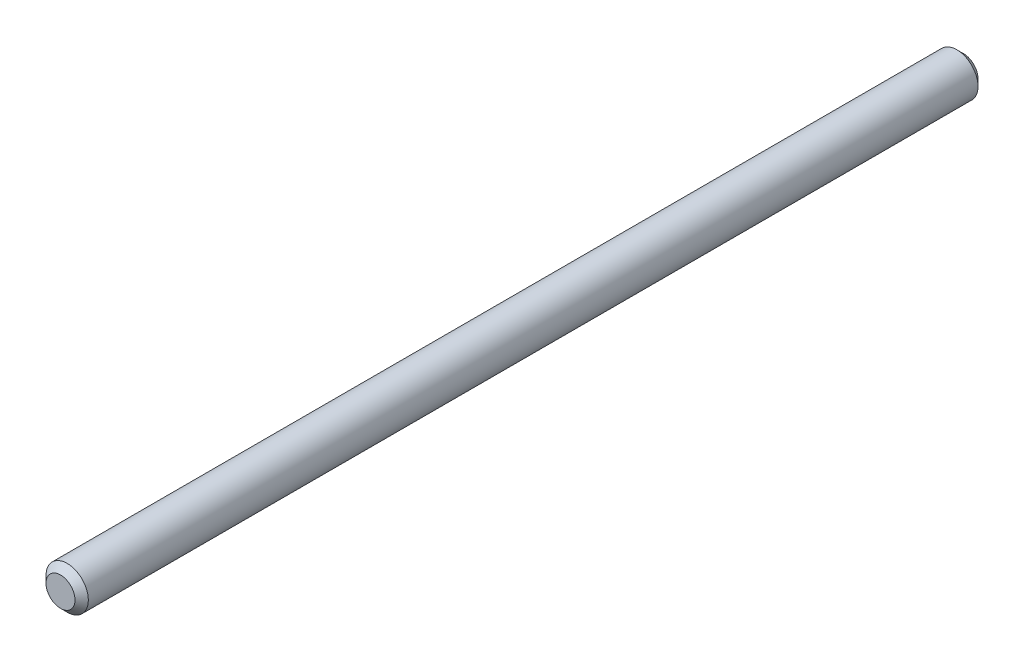
ISO-10303-21;
HEADER;
FILE_DESCRIPTION(('STEP AP214'),'2;1');
FILE_NAME('part.step','',(''),(''),'','','');
FILE_SCHEMA(('AUTOMOTIVE_DESIGN { 1 0 10303 214 1 1 1 1 }'));
ENDSEC;
DATA;
#1=APPLICATION_CONTEXT('core data for automotive mechanical design processes');
#2=APPLICATION_PROTOCOL_DEFINITION('international standard','automotive_design',2000,#1);
#3=PRODUCT_CONTEXT('',#1,'mechanical');
#4=PRODUCT('Part','Part','',(#3));
#5=PRODUCT_RELATED_PRODUCT_CATEGORY('part','',(#4));
#6=PRODUCT_DEFINITION_FORMATION('','',#4);
#7=PRODUCT_DEFINITION_CONTEXT('part definition',#1,'design');
#8=PRODUCT_DEFINITION('design','',#6,#7);
#9=PRODUCT_DEFINITION_SHAPE('','',#8);
#10=(LENGTH_UNIT() NAMED_UNIT(*) SI_UNIT(.MILLI.,.METRE.));
#11=(NAMED_UNIT(*) PLANE_ANGLE_UNIT() SI_UNIT($,.RADIAN.));
#12=(NAMED_UNIT(*) SI_UNIT($,.STERADIAN.) SOLID_ANGLE_UNIT());
#13=UNCERTAINTY_MEASURE_WITH_UNIT(LENGTH_MEASURE(1.E-05),#10,'distance_accuracy_value','');
#14=(GEOMETRIC_REPRESENTATION_CONTEXT(3) GLOBAL_UNCERTAINTY_ASSIGNED_CONTEXT((#13)) GLOBAL_UNIT_ASSIGNED_CONTEXT((#10,
#11,#12)) REPRESENTATION_CONTEXT('',''));
#15=CARTESIAN_POINT('',(0.,0.,0.));
#16=DIRECTION('',(0.,0.,1.));
#17=DIRECTION('',(1.,0.,0.));
#18=AXIS2_PLACEMENT_3D('',#15,#16,#17);
#19=CARTESIAN_POINT('',(0.,0.,-135.470000078));
#20=DIRECTION('',(0.,0.,0.999999999999999));
#21=DIRECTION('',(1.,0.,0.));
#22=AXIS2_PLACEMENT_3D('',#19,#20,#21);
#23=CYLINDRICAL_SURFACE('',#22,3.175);
#24=CARTESIAN_POINT('',(0.,0.,-134.470000078));
#25=DIRECTION('',(0.,0.,0.999999999999999));
#26=DIRECTION('',(1.,0.,0.));
#27=AXIS2_PLACEMENT_3D('',#24,#25,#26);
#28=CIRCLE('',#27,3.175);
#29=CARTESIAN_POINT('',(3.175,0.,-134.470000078));
#30=VERTEX_POINT('',#29);
#31=EDGE_CURVE('E49',#30,#30,#28,.T.);
#32=ORIENTED_EDGE('',*,*,#31,.T.);
#33=EDGE_LOOP('',(#32));
#34=FACE_BOUND('',#33,.T.);
#35=CARTESIAN_POINT('',(0.,0.,-0.999999999999987));
#36=DIRECTION('',(0.,0.,0.999999999999999));
#37=DIRECTION('',(1.,0.,0.));
#38=AXIS2_PLACEMENT_3D('',#35,#36,#37);
#39=CIRCLE('',#38,3.175);
#40=CARTESIAN_POINT('',(3.175,0.,-0.999999999999987));
#41=VERTEX_POINT('',#40);
#42=EDGE_CURVE('E53',#41,#41,#39,.F.);
#43=ORIENTED_EDGE('',*,*,#42,.T.);
#44=EDGE_LOOP('',(#43));
#45=FACE_BOUND('',#44,.T.);
#46=ADVANCED_FACE('F38',(#34,#45),#23,.T.);
#47=CARTESIAN_POINT('',(0.,0.,-135.470000078));
#48=DIRECTION('',(0.,0.,0.999999999999999));
#49=DIRECTION('',(1.,0.,0.));
#50=AXIS2_PLACEMENT_3D('',#47,#48,#49);
#51=PLANE('',#50);
#52=CARTESIAN_POINT('',(0.,0.,-135.470000078));
#53=DIRECTION('',(0.,0.,0.999999999999999));
#54=DIRECTION('',(1.,0.,0.));
#55=AXIS2_PLACEMENT_3D('',#52,#53,#54);
#56=CIRCLE('',#55,2.17500000000001);
#57=CARTESIAN_POINT('',(2.17500000000001,0.,-135.470000078));
#58=VERTEX_POINT('',#57);
#59=EDGE_CURVE('E45',#58,#58,#56,.F.);
#60=ORIENTED_EDGE('',*,*,#59,.T.);
#61=EDGE_LOOP('',(#60));
#62=FACE_BOUND('',#61,.T.);
#63=ADVANCED_FACE('F69',(#62),#51,.F.);
#64=CARTESIAN_POINT('',(0.,0.,0.));
#65=DIRECTION('',(0.,0.,0.999999999999999));
#66=DIRECTION('',(1.,0.,0.));
#67=AXIS2_PLACEMENT_3D('',#64,#65,#66);
#68=PLANE('',#67);
#69=CARTESIAN_POINT('',(0.,0.,0.));
#70=DIRECTION('',(0.,0.,0.999999999999999));
#71=DIRECTION('',(1.,0.,0.));
#72=AXIS2_PLACEMENT_3D('',#69,#70,#71);
#73=CIRCLE('',#72,2.17500000000001);
#74=CARTESIAN_POINT('',(2.17500000000001,0.,0.));
#75=VERTEX_POINT('',#74);
#76=EDGE_CURVE('E10',#75,#75,#73,.T.);
#77=ORIENTED_EDGE('',*,*,#76,.T.);
#78=EDGE_LOOP('',(#77));
#79=FACE_BOUND('',#78,.T.);
#80=ADVANCED_FACE('F66',(#79),#68,.T.);
#81=CARTESIAN_POINT('',(0.,0.,-134.470000078));
#82=DIRECTION('',(0.,0.,0.999999999999999));
#83=DIRECTION('',(1.,0.,0.));
#84=AXIS2_PLACEMENT_3D('',#81,#82,#83);
#85=CONICAL_SURFACE('',#84,3.175,0.785398163397443);
#86=ORIENTED_EDGE('',*,*,#59,.F.);
#87=EDGE_LOOP('',(#86));
#88=FACE_BOUND('',#87,.T.);
#89=ORIENTED_EDGE('',*,*,#31,.F.);
#90=EDGE_LOOP('',(#89));
#91=FACE_BOUND('',#90,.T.);
#92=ADVANCED_FACE('F62',(#88,#91),#85,.T.);
#93=CARTESIAN_POINT('',(0.,0.,0.));
#94=DIRECTION('',(0.,0.,-0.999999999999999));
#95=DIRECTION('',(-1.,0.,0.));
#96=AXIS2_PLACEMENT_3D('',#93,#94,#95);
#97=CONICAL_SURFACE('',#96,2.17500000000001,0.785398163397443);
#98=ORIENTED_EDGE('',*,*,#42,.F.);
#99=EDGE_LOOP('',(#98));
#100=FACE_BOUND('',#99,.T.);
#101=ORIENTED_EDGE('',*,*,#76,.F.);
#102=EDGE_LOOP('',(#101));
#103=FACE_BOUND('',#102,.T.);
#104=ADVANCED_FACE('F40',(#100,#103),#97,.T.);
#105=CLOSED_SHELL('',(#46,#63,#80,#92,#104));
#106=MANIFOLD_SOLID_BREP('B2',#105);
#107=ADVANCED_BREP_SHAPE_REPRESENTATION('',(#18,#106),#14);
#108=SHAPE_DEFINITION_REPRESENTATION(#9,#107);
ENDSEC;
END-ISO-10303-21;
